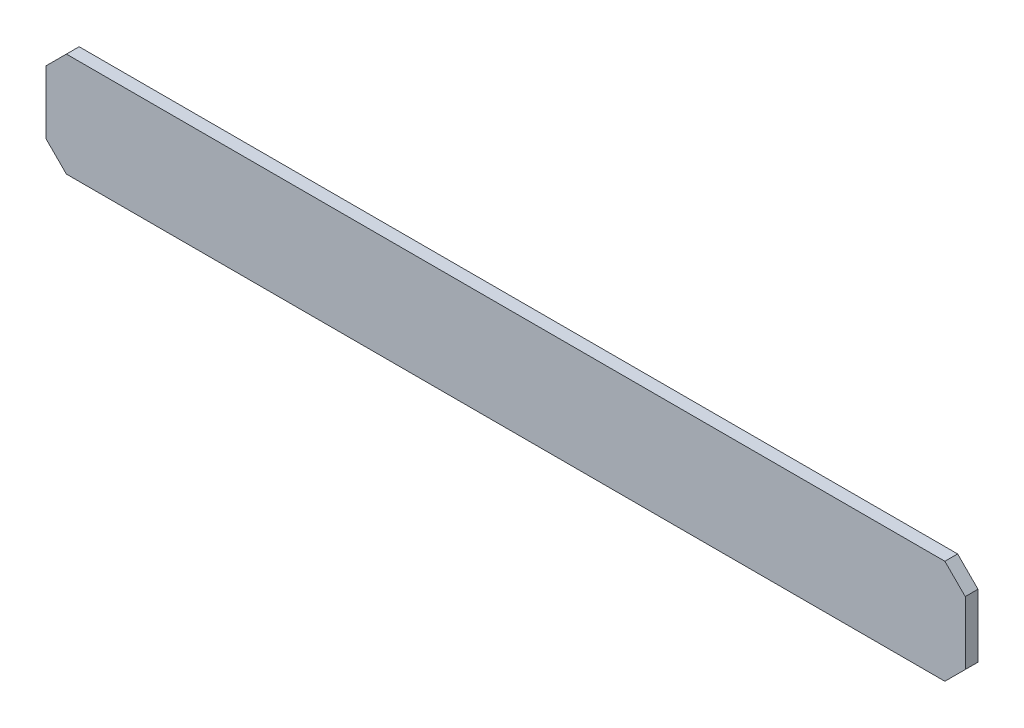
ISO-10303-21;
HEADER;
FILE_DESCRIPTION(('STEP AP214'),'2;1');
FILE_NAME('part.step','',(''),(''),'','','');
FILE_SCHEMA(('AUTOMOTIVE_DESIGN { 1 0 10303 214 1 1 1 1 }'));
ENDSEC;
DATA;
#1=APPLICATION_CONTEXT('core data for automotive mechanical design processes');
#2=APPLICATION_PROTOCOL_DEFINITION('international standard','automotive_design',2000,#1);
#3=PRODUCT_CONTEXT('',#1,'mechanical');
#4=PRODUCT('Part','Part','',(#3));
#5=PRODUCT_RELATED_PRODUCT_CATEGORY('part','',(#4));
#6=PRODUCT_DEFINITION_FORMATION('','',#4);
#7=PRODUCT_DEFINITION_CONTEXT('part definition',#1,'design');
#8=PRODUCT_DEFINITION('design','',#6,#7);
#9=PRODUCT_DEFINITION_SHAPE('','',#8);
#10=(LENGTH_UNIT() NAMED_UNIT(*) SI_UNIT(.MILLI.,.METRE.));
#11=(NAMED_UNIT(*) PLANE_ANGLE_UNIT() SI_UNIT($,.RADIAN.));
#12=(NAMED_UNIT(*) SI_UNIT($,.STERADIAN.) SOLID_ANGLE_UNIT());
#13=UNCERTAINTY_MEASURE_WITH_UNIT(LENGTH_MEASURE(1.E-05),#10,'distance_accuracy_value','');
#14=(GEOMETRIC_REPRESENTATION_CONTEXT(3) GLOBAL_UNCERTAINTY_ASSIGNED_CONTEXT((#13)) GLOBAL_UNIT_ASSIGNED_CONTEXT((#10,
#11,#12)) REPRESENTATION_CONTEXT('',''));
#15=CARTESIAN_POINT('',(0.,0.,0.));
#16=DIRECTION('',(0.,0.,1.));
#17=DIRECTION('',(1.,0.,0.));
#18=AXIS2_PLACEMENT_3D('',#15,#16,#17);
#19=CARTESIAN_POINT('',(-57.277,-50.1428796998615,-3.14519999999992));
#20=DIRECTION('',(1.,0.,0.));
#21=DIRECTION('',(0.,0.,-1.));
#22=AXIS2_PLACEMENT_3D('',#19,#20,#21);
#23=PLANE('',#22);
#24=DIRECTION('',(0.,-1.,0.));
#25=VECTOR('',#24,1.);
#26=CARTESIAN_POINT('',(-57.277,-50.1428796998615,-3.14519999999992));
#27=LINE('',#26,#25);
#28=CARTESIAN_POINT('',(-57.277,-52.6828796998615,-3.14519999999992));
#29=VERTEX_POINT('',#28);
#30=CARTESIAN_POINT('',(-57.277,-60.556879699861,-3.14519999999992));
#31=VERTEX_POINT('',#30);
#32=EDGE_CURVE('E126',#29,#31,#27,.T.);
#33=ORIENTED_EDGE('',*,*,#32,.F.);
#34=DIRECTION('',(0.,0.,-1.));
#35=VECTOR('',#34,1.);
#36=CARTESIAN_POINT('',(-57.277,-52.6828796998615,-3.14519999999992));
#37=LINE('',#36,#35);
#38=CARTESIAN_POINT('',(-57.277,-52.6828796998614,-4.73269999999992));
#39=VERTEX_POINT('',#38);
#40=EDGE_CURVE('E111',#29,#39,#37,.T.);
#41=ORIENTED_EDGE('',*,*,#40,.T.);
#42=DIRECTION('',(0.,-1.,0.));
#43=VECTOR('',#42,1.);
#44=CARTESIAN_POINT('',(-57.277,-50.1428796998615,-4.73269999999992));
#45=LINE('',#44,#43);
#46=CARTESIAN_POINT('',(-57.277,-60.556879699861,-4.73269999999992));
#47=VERTEX_POINT('',#46);
#48=EDGE_CURVE('E123',#39,#47,#45,.T.);
#49=ORIENTED_EDGE('',*,*,#48,.T.);
#50=DIRECTION('',(0.,0.,1.));
#51=VECTOR('',#50,1.);
#52=CARTESIAN_POINT('',(-57.277,-60.556879699861,-3.14519999999992));
#53=LINE('',#52,#51);
#54=EDGE_CURVE('E128',#47,#31,#53,.T.);
#55=ORIENTED_EDGE('',*,*,#54,.T.);
#56=EDGE_LOOP('',(#33,#41,#49,#55));
#57=FACE_BOUND('',#56,.T.);
#58=ADVANCED_FACE('F42',(#57),#23,.F.);
#59=CARTESIAN_POINT('',(57.2770005080001,-63.096879699861,-3.14519999999992));
#60=DIRECTION('',(0.,1.,0.));
#61=DIRECTION('',(0.,0.,1.));
#62=AXIS2_PLACEMENT_3D('',#59,#60,#61);
#63=PLANE('',#62);
#64=DIRECTION('',(1.,0.,0.));
#65=VECTOR('',#64,1.);
#66=CARTESIAN_POINT('',(57.2770005080001,-63.096879699861,-3.14519999999992));
#67=LINE('',#66,#65);
#68=CARTESIAN_POINT('',(-54.737,-63.096879699861,-3.14519999999992));
#69=VERTEX_POINT('',#68);
#70=CARTESIAN_POINT('',(54.7370005080002,-63.096879699861,-3.14519999999992));
#71=VERTEX_POINT('',#70);
#72=EDGE_CURVE('E177',#69,#71,#67,.T.);
#73=ORIENTED_EDGE('',*,*,#72,.F.);
#74=DIRECTION('',(0.,0.,-1.));
#75=VECTOR('',#74,1.);
#76=CARTESIAN_POINT('',(-54.737,-63.096879699861,-3.14519999999992));
#77=LINE('',#76,#75);
#78=CARTESIAN_POINT('',(-54.737,-63.096879699861,-4.73269999999992));
#79=VERTEX_POINT('',#78);
#80=EDGE_CURVE('E161',#69,#79,#77,.T.);
#81=ORIENTED_EDGE('',*,*,#80,.T.);
#82=DIRECTION('',(1.,0.,0.));
#83=VECTOR('',#82,1.);
#84=CARTESIAN_POINT('',(57.2770005080001,-63.096879699861,-4.73269999999992));
#85=LINE('',#84,#83);
#86=CARTESIAN_POINT('',(54.7370005080002,-63.096879699861,-4.73269999999992));
#87=VERTEX_POINT('',#86);
#88=EDGE_CURVE('E132',#79,#87,#85,.T.);
#89=ORIENTED_EDGE('',*,*,#88,.T.);
#90=DIRECTION('',(0.,0.,1.));
#91=VECTOR('',#90,1.);
#92=CARTESIAN_POINT('',(54.7370005080002,-63.096879699861,-3.14519999999992));
#93=LINE('',#92,#91);
#94=EDGE_CURVE('E159',#87,#71,#93,.T.);
#95=ORIENTED_EDGE('',*,*,#94,.T.);
#96=EDGE_LOOP('',(#73,#81,#89,#95));
#97=FACE_BOUND('',#96,.T.);
#98=ADVANCED_FACE('F187',(#97),#63,.F.);
#99=CARTESIAN_POINT('',(57.2770005080001,-50.1428796998615,-3.14519999999992));
#100=DIRECTION('',(-1.,0.,0.));
#101=DIRECTION('',(0.,0.,1.));
#102=AXIS2_PLACEMENT_3D('',#99,#100,#101);
#103=PLANE('',#102);
#104=DIRECTION('',(0.,1.,0.));
#105=VECTOR('',#104,1.);
#106=CARTESIAN_POINT('',(57.2770005080001,-50.1428796998615,-4.73269999999992));
#107=LINE('',#106,#105);
#108=CARTESIAN_POINT('',(57.2770005080001,-60.556879699861,-4.73269999999992));
#109=VERTEX_POINT('',#108);
#110=CARTESIAN_POINT('',(57.2770005080001,-52.6828796998615,-4.73269999999993));
#111=VERTEX_POINT('',#110);
#112=EDGE_CURVE('E135',#109,#111,#107,.T.);
#113=ORIENTED_EDGE('',*,*,#112,.T.);
#114=DIRECTION('',(0.,0.,1.));
#115=VECTOR('',#114,1.);
#116=CARTESIAN_POINT('',(57.2770005080001,-52.6828796998615,-3.14519999999992));
#117=LINE('',#116,#115);
#118=CARTESIAN_POINT('',(57.2770005080001,-52.6828796998615,-3.14519999999992));
#119=VERTEX_POINT('',#118);
#120=EDGE_CURVE('E11',#111,#119,#117,.T.);
#121=ORIENTED_EDGE('',*,*,#120,.T.);
#122=DIRECTION('',(0.,1.,0.));
#123=VECTOR('',#122,1.);
#124=CARTESIAN_POINT('',(57.2770005080001,-50.1428796998615,-3.14519999999992));
#125=LINE('',#124,#123);
#126=CARTESIAN_POINT('',(57.2770005080001,-60.556879699861,-3.14519999999992));
#127=VERTEX_POINT('',#126);
#128=EDGE_CURVE('E167',#127,#119,#125,.T.);
#129=ORIENTED_EDGE('',*,*,#128,.F.);
#130=DIRECTION('',(0.,0.,-1.));
#131=VECTOR('',#130,1.);
#132=CARTESIAN_POINT('',(57.2770005080001,-60.556879699861,-3.14519999999992));
#133=LINE('',#132,#131);
#134=EDGE_CURVE('E50',#127,#109,#133,.T.);
#135=ORIENTED_EDGE('',*,*,#134,.T.);
#136=EDGE_LOOP('',(#113,#121,#129,#135));
#137=FACE_BOUND('',#136,.T.);
#138=ADVANCED_FACE('F166',(#137),#103,.F.);
#139=CARTESIAN_POINT('',(57.2770005080001,-50.1428796998615,-3.14519999999992));
#140=DIRECTION('',(0.,-1.,0.));
#141=DIRECTION('',(0.,0.,-1.));
#142=AXIS2_PLACEMENT_3D('',#139,#140,#141);
#143=PLANE('',#142);
#144=DIRECTION('',(-1.,0.,0.));
#145=VECTOR('',#144,1.);
#146=CARTESIAN_POINT('',(57.2770005080001,-50.1428796998615,-4.73269999999992));
#147=LINE('',#146,#145);
#148=CARTESIAN_POINT('',(54.7370005080002,-50.1428796998615,-4.73269999999992));
#149=VERTEX_POINT('',#148);
#150=CARTESIAN_POINT('',(-54.737,-50.1428796998615,-4.73269999999992));
#151=VERTEX_POINT('',#150);
#152=EDGE_CURVE('E142',#149,#151,#147,.T.);
#153=ORIENTED_EDGE('',*,*,#152,.T.);
#154=DIRECTION('',(0.,0.,1.));
#155=VECTOR('',#154,1.);
#156=CARTESIAN_POINT('',(-54.737,-50.1428796998615,-3.14519999999992));
#157=LINE('',#156,#155);
#158=CARTESIAN_POINT('',(-54.737,-50.1428796998615,-3.14519999999992));
#159=VERTEX_POINT('',#158);
#160=EDGE_CURVE('E112',#151,#159,#157,.T.);
#161=ORIENTED_EDGE('',*,*,#160,.T.);
#162=DIRECTION('',(-1.,0.,0.));
#163=VECTOR('',#162,1.);
#164=CARTESIAN_POINT('',(57.2770005080001,-50.1428796998615,-3.14519999999992));
#165=LINE('',#164,#163);
#166=CARTESIAN_POINT('',(54.7370005080002,-50.1428796998615,-3.14519999999992));
#167=VERTEX_POINT('',#166);
#168=EDGE_CURVE('E138',#167,#159,#165,.T.);
#169=ORIENTED_EDGE('',*,*,#168,.F.);
#170=DIRECTION('',(0.,0.,-1.));
#171=VECTOR('',#170,1.);
#172=CARTESIAN_POINT('',(54.7370005080002,-50.1428796998615,-3.14519999999992));
#173=LINE('',#172,#171);
#174=EDGE_CURVE('E117',#167,#149,#173,.T.);
#175=ORIENTED_EDGE('',*,*,#174,.T.);
#176=EDGE_LOOP('',(#153,#161,#169,#175));
#177=FACE_BOUND('',#176,.T.);
#178=ADVANCED_FACE('F175',(#177),#143,.F.);
#179=CARTESIAN_POINT('',(0.,0.,-3.14519999999992));
#180=DIRECTION('',(0.,0.,-1.));
#181=DIRECTION('',(-1.,0.,0.));
#182=AXIS2_PLACEMENT_3D('',#179,#180,#181);
#183=PLANE('',#182);
#184=ORIENTED_EDGE('',*,*,#168,.T.);
#185=DIRECTION('',(0.707106781186549,0.707106781186546,0.));
#186=VECTOR('',#185,1.);
#187=CARTESIAN_POINT('',(-57.277,-52.6828796998615,-3.14519999999992));
#188=LINE('',#187,#186);
#189=EDGE_CURVE('E157',#159,#29,#188,.F.);
#190=ORIENTED_EDGE('',*,*,#189,.T.);
#191=ORIENTED_EDGE('',*,*,#32,.T.);
#192=DIRECTION('',(-0.707106781186546,0.707106781186549,0.));
#193=VECTOR('',#192,1.);
#194=CARTESIAN_POINT('',(-54.737,-63.096879699861,-3.14519999999992));
#195=LINE('',#194,#193);
#196=EDGE_CURVE('E155',#31,#69,#195,.F.);
#197=ORIENTED_EDGE('',*,*,#196,.T.);
#198=ORIENTED_EDGE('',*,*,#72,.T.);
#199=DIRECTION('',(-0.707106781186549,-0.707106781186546,0.));
#200=VECTOR('',#199,1.);
#201=CARTESIAN_POINT('',(57.2770005080001,-60.556879699861,-3.14519999999992));
#202=LINE('',#201,#200);
#203=EDGE_CURVE('E62',#71,#127,#202,.F.);
#204=ORIENTED_EDGE('',*,*,#203,.T.);
#205=ORIENTED_EDGE('',*,*,#128,.T.);
#206=DIRECTION('',(0.707106781186546,-0.70710678118655,0.));
#207=VECTOR('',#206,1.);
#208=CARTESIAN_POINT('',(54.7370005080002,-50.1428796998615,-3.14519999999992));
#209=LINE('',#208,#207);
#210=EDGE_CURVE('E153',#119,#167,#209,.F.);
#211=ORIENTED_EDGE('',*,*,#210,.T.);
#212=EDGE_LOOP('',(#184,#190,#191,#197,#198,#204,#205,#211));
#213=FACE_BOUND('',#212,.T.);
#214=ADVANCED_FACE('F181',(#213),#183,.F.);
#215=CARTESIAN_POINT('',(0.,0.,-4.73269999999992));
#216=DIRECTION('',(0.,0.,-1.));
#217=DIRECTION('',(-1.,0.,0.));
#218=AXIS2_PLACEMENT_3D('',#215,#216,#217);
#219=PLANE('',#218);
#220=ORIENTED_EDGE('',*,*,#48,.F.);
#221=DIRECTION('',(-0.707106781186549,-0.707106781186546,0.));
#222=VECTOR('',#221,1.);
#223=CARTESIAN_POINT('',(-2.29706015006911,2.29706015006913,-4.73269999999992));
#224=LINE('',#223,#222);
#225=EDGE_CURVE('E107',#39,#151,#224,.F.);
#226=ORIENTED_EDGE('',*,*,#225,.T.);
#227=ORIENTED_EDGE('',*,*,#152,.F.);
#228=DIRECTION('',(-0.707106781186546,0.70710678118655,0.));
#229=VECTOR('',#228,1.);
#230=CARTESIAN_POINT('',(2.29706040406949,2.29706040406948,-4.73269999999992));
#231=LINE('',#230,#229);
#232=EDGE_CURVE('E146',#149,#111,#231,.F.);
#233=ORIENTED_EDGE('',*,*,#232,.T.);
#234=ORIENTED_EDGE('',*,*,#112,.F.);
#235=DIRECTION('',(0.707106781186549,0.707106781186546,0.));
#236=VECTOR('',#235,1.);
#237=CARTESIAN_POINT('',(58.9169401039304,-58.9169401039307,-4.73269999999992));
#238=LINE('',#237,#236);
#239=EDGE_CURVE('E127',#109,#87,#238,.F.);
#240=ORIENTED_EDGE('',*,*,#239,.T.);
#241=ORIENTED_EDGE('',*,*,#88,.F.);
#242=DIRECTION('',(0.707106781186546,-0.707106781186549,0.));
#243=VECTOR('',#242,1.);
#244=CARTESIAN_POINT('',(-58.9169398499306,-58.9169398499303,-4.73269999999992));
#245=LINE('',#244,#243);
#246=EDGE_CURVE('E118',#79,#47,#245,.F.);
#247=ORIENTED_EDGE('',*,*,#246,.T.);
#248=EDGE_LOOP('',(#220,#226,#227,#233,#234,#240,#241,#247));
#249=FACE_BOUND('',#248,.T.);
#250=ADVANCED_FACE('F130',(#249),#219,.T.);
#251=CARTESIAN_POINT('',(-57.277,-52.6828796998615,-3.14519999999992));
#252=DIRECTION('',(0.707106781186546,-0.707106781186549,0.));
#253=DIRECTION('',(0.,0.,-1.));
#254=AXIS2_PLACEMENT_3D('',#251,#252,#253);
#255=PLANE('',#254);
#256=ORIENTED_EDGE('',*,*,#189,.F.);
#257=ORIENTED_EDGE('',*,*,#160,.F.);
#258=ORIENTED_EDGE('',*,*,#225,.F.);
#259=ORIENTED_EDGE('',*,*,#40,.F.);
#260=EDGE_LOOP('',(#256,#257,#258,#259));
#261=FACE_BOUND('',#260,.T.);
#262=ADVANCED_FACE('F110',(#261),#255,.F.);
#263=CARTESIAN_POINT('',(-54.737,-63.096879699861,-3.14519999999992));
#264=DIRECTION('',(0.707106781186549,0.707106781186546,0.));
#265=DIRECTION('',(0.,0.,-1.));
#266=AXIS2_PLACEMENT_3D('',#263,#264,#265);
#267=PLANE('',#266);
#268=ORIENTED_EDGE('',*,*,#196,.F.);
#269=ORIENTED_EDGE('',*,*,#54,.F.);
#270=ORIENTED_EDGE('',*,*,#246,.F.);
#271=ORIENTED_EDGE('',*,*,#80,.F.);
#272=EDGE_LOOP('',(#268,#269,#270,#271));
#273=FACE_BOUND('',#272,.T.);
#274=ADVANCED_FACE('F185',(#273),#267,.F.);
#275=CARTESIAN_POINT('',(54.7370005080002,-50.1428796998615,-3.14519999999992));
#276=DIRECTION('',(-0.70710678118655,-0.707106781186546,0.));
#277=DIRECTION('',(0.,0.,-1.));
#278=AXIS2_PLACEMENT_3D('',#275,#276,#277);
#279=PLANE('',#278);
#280=ORIENTED_EDGE('',*,*,#210,.F.);
#281=ORIENTED_EDGE('',*,*,#120,.F.);
#282=ORIENTED_EDGE('',*,*,#232,.F.);
#283=ORIENTED_EDGE('',*,*,#174,.F.);
#284=EDGE_LOOP('',(#280,#281,#282,#283));
#285=FACE_BOUND('',#284,.T.);
#286=ADVANCED_FACE('F172',(#285),#279,.F.);
#287=CARTESIAN_POINT('',(57.2770005080001,-60.556879699861,-3.14519999999992));
#288=DIRECTION('',(-0.707106781186546,0.707106781186549,0.));
#289=DIRECTION('',(0.,0.,-1.));
#290=AXIS2_PLACEMENT_3D('',#287,#288,#289);
#291=PLANE('',#290);
#292=ORIENTED_EDGE('',*,*,#203,.F.);
#293=ORIENTED_EDGE('',*,*,#94,.F.);
#294=ORIENTED_EDGE('',*,*,#239,.F.);
#295=ORIENTED_EDGE('',*,*,#134,.F.);
#296=EDGE_LOOP('',(#292,#293,#294,#295));
#297=FACE_BOUND('',#296,.T.);
#298=ADVANCED_FACE('F44',(#297),#291,.F.);
#299=CLOSED_SHELL('',(#58,#98,#138,#178,#214,#250,#262,#274,#286,#298));
#300=MANIFOLD_SOLID_BREP('B2',#299);
#301=ADVANCED_BREP_SHAPE_REPRESENTATION('',(#18,#300),#14);
#302=SHAPE_DEFINITION_REPRESENTATION(#9,#301);
ENDSEC;
END-ISO-10303-21;
